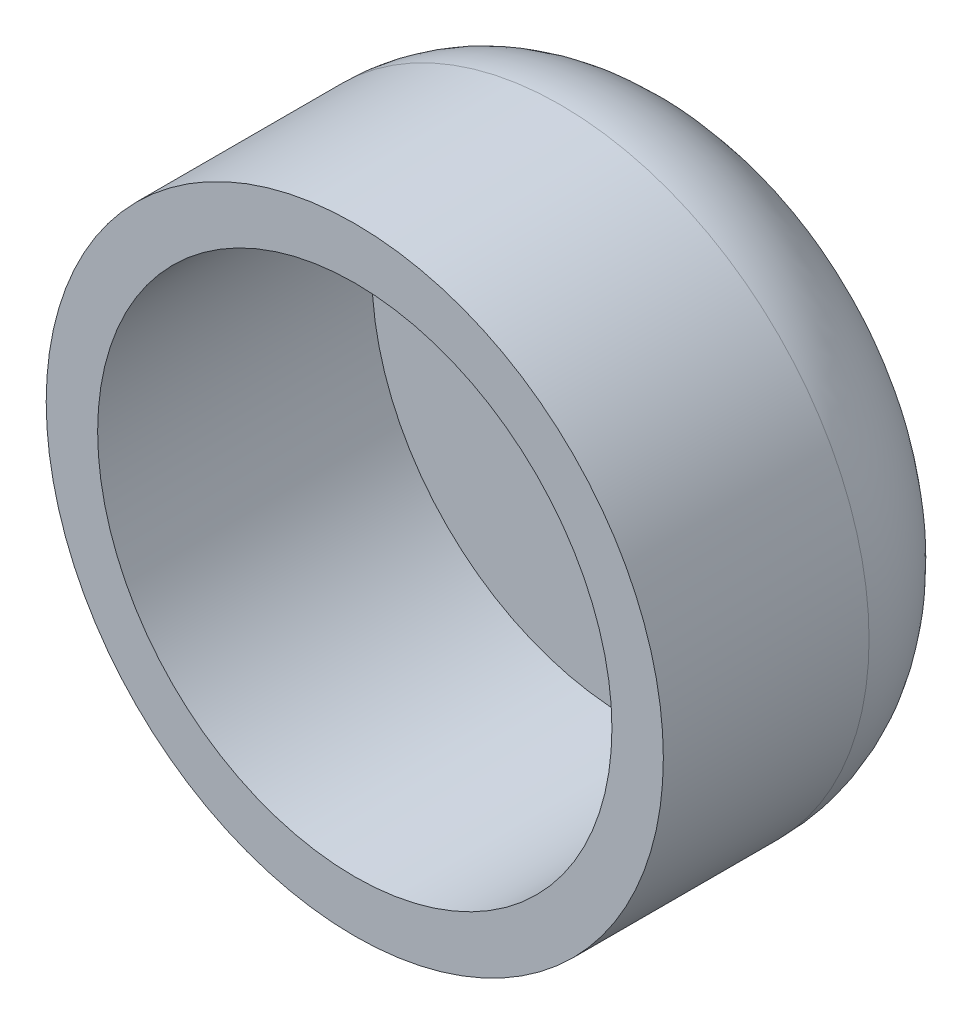
ISO-10303-21;
HEADER;
FILE_DESCRIPTION(('STEP AP214'),'2;1');
FILE_NAME('part.step','',(''),(''),'','','');
FILE_SCHEMA(('AUTOMOTIVE_DESIGN { 1 0 10303 214 1 1 1 1 }'));
ENDSEC;
DATA;
#1=APPLICATION_CONTEXT('core data for automotive mechanical design processes');
#2=APPLICATION_PROTOCOL_DEFINITION('international standard','automotive_design',2000,#1);
#3=PRODUCT_CONTEXT('',#1,'mechanical');
#4=PRODUCT('Part','Part','',(#3));
#5=PRODUCT_RELATED_PRODUCT_CATEGORY('part','',(#4));
#6=PRODUCT_DEFINITION_FORMATION('','',#4);
#7=PRODUCT_DEFINITION_CONTEXT('part definition',#1,'design');
#8=PRODUCT_DEFINITION('design','',#6,#7);
#9=PRODUCT_DEFINITION_SHAPE('','',#8);
#10=(LENGTH_UNIT() NAMED_UNIT(*) SI_UNIT(.MILLI.,.METRE.));
#11=(NAMED_UNIT(*) PLANE_ANGLE_UNIT() SI_UNIT($,.RADIAN.));
#12=(NAMED_UNIT(*) SI_UNIT($,.STERADIAN.) SOLID_ANGLE_UNIT());
#13=UNCERTAINTY_MEASURE_WITH_UNIT(LENGTH_MEASURE(1.E-05),#10,'distance_accuracy_value','');
#14=(GEOMETRIC_REPRESENTATION_CONTEXT(3) GLOBAL_UNCERTAINTY_ASSIGNED_CONTEXT((#13)) GLOBAL_UNIT_ASSIGNED_CONTEXT((#10,
#11,#12)) REPRESENTATION_CONTEXT('',''));
#15=CARTESIAN_POINT('',(0.,0.,0.));
#16=DIRECTION('',(0.,0.,1.));
#17=DIRECTION('',(1.,0.,0.));
#18=AXIS2_PLACEMENT_3D('',#15,#16,#17);
#19=CARTESIAN_POINT('',(0.,0.,-0.5));
#20=DIRECTION('',(0.,0.,1.));
#21=DIRECTION('',(1.,0.,0.));
#22=AXIS2_PLACEMENT_3D('',#19,#20,#21);
#23=CYLINDRICAL_SURFACE('',#22,0.9);
#24=CARTESIAN_POINT('',(0.,0.,-0.1));
#25=DIRECTION('',(0.,0.,1.));
#26=DIRECTION('',(1.,0.,0.));
#27=AXIS2_PLACEMENT_3D('',#24,#25,#26);
#28=CIRCLE('',#27,0.9);
#29=CARTESIAN_POINT('',(0.9,0.,-0.1));
#30=VERTEX_POINT('',#29);
#31=EDGE_CURVE('E44',#30,#30,#28,.T.);
#32=ORIENTED_EDGE('',*,*,#31,.T.);
#33=EDGE_LOOP('',(#32));
#34=FACE_BOUND('',#33,.T.);
#35=CARTESIAN_POINT('',(0.,0.,0.5));
#36=DIRECTION('',(0.,0.,1.));
#37=DIRECTION('',(1.00000000000001,0.,0.));
#38=AXIS2_PLACEMENT_3D('',#35,#36,#37);
#39=CIRCLE('',#38,0.9);
#40=CARTESIAN_POINT('',(0.900000000000009,0.,0.5));
#41=VERTEX_POINT('',#40);
#42=EDGE_CURVE('E57',#41,#41,#39,.T.);
#43=ORIENTED_EDGE('',*,*,#42,.F.);
#44=EDGE_LOOP('',(#43));
#45=FACE_BOUND('',#44,.T.);
#46=ADVANCED_FACE('F37',(#34,#45),#23,.T.);
#47=CARTESIAN_POINT('',(0.,0.,-0.5));
#48=DIRECTION('',(0.,0.,1.));
#49=DIRECTION('',(1.,0.,0.));
#50=AXIS2_PLACEMENT_3D('',#47,#48,#49);
#51=PLANE('',#50);
#52=CARTESIAN_POINT('',(0.,0.,-0.5));
#53=DIRECTION('',(0.,0.,1.));
#54=DIRECTION('',(1.,0.,0.));
#55=AXIS2_PLACEMENT_3D('',#52,#53,#54);
#56=CIRCLE('',#55,0.5);
#57=CARTESIAN_POINT('',(0.5,0.,-0.5));
#58=VERTEX_POINT('',#57);
#59=EDGE_CURVE('E10',#58,#58,#56,.F.);
#60=ORIENTED_EDGE('',*,*,#59,.T.);
#61=EDGE_LOOP('',(#60));
#62=FACE_BOUND('',#61,.T.);
#63=ADVANCED_FACE('F65',(#62),#51,.F.);
#64=CARTESIAN_POINT('',(0.,0.,-0.1));
#65=DIRECTION('',(0.,0.,1.));
#66=DIRECTION('',(1.,0.,0.));
#67=AXIS2_PLACEMENT_3D('',#64,#65,#66);
#68=TOROIDAL_SURFACE('',#67,0.5,0.4);
#69=ORIENTED_EDGE('',*,*,#59,.F.);
#70=EDGE_LOOP('',(#69));
#71=FACE_BOUND('',#70,.T.);
#72=ORIENTED_EDGE('',*,*,#31,.F.);
#73=EDGE_LOOP('',(#72));
#74=FACE_BOUND('',#73,.T.);
#75=ADVANCED_FACE('F39',(#71,#74),#68,.T.);
#76=CARTESIAN_POINT('',(0.,0.,0.5));
#77=DIRECTION('',(0.,0.,1.));
#78=DIRECTION('',(1.00000000000001,0.,0.));
#79=AXIS2_PLACEMENT_3D('',#76,#77,#78);
#80=PLANE('',#79);
#81=ORIENTED_EDGE('',*,*,#42,.T.);
#82=EDGE_LOOP('',(#81));
#83=FACE_BOUND('',#82,.T.);
#84=CARTESIAN_POINT('',(0.,0.,0.5));
#85=DIRECTION('',(0.,0.,1.));
#86=DIRECTION('',(1.00000000000001,0.,0.));
#87=AXIS2_PLACEMENT_3D('',#84,#85,#86);
#88=CIRCLE('',#87,0.75);
#89=CARTESIAN_POINT('',(0.750000000000008,0.,0.5));
#90=VERTEX_POINT('',#89);
#91=EDGE_CURVE('E52',#90,#90,#88,.F.);
#92=ORIENTED_EDGE('',*,*,#91,.T.);
#93=EDGE_LOOP('',(#92));
#94=FACE_BOUND('',#93,.T.);
#95=ADVANCED_FACE('F61',(#83,#94),#80,.T.);
#96=CARTESIAN_POINT('',(0.,0.,-0.3));
#97=DIRECTION('',(0.,0.,1.));
#98=DIRECTION('',(1.,0.,0.));
#99=AXIS2_PLACEMENT_3D('',#96,#97,#98);
#100=PLANE('',#99);
#101=CARTESIAN_POINT('',(0.,0.,-0.3));
#102=DIRECTION('',(0.,0.,1.));
#103=DIRECTION('',(1.,0.,0.));
#104=AXIS2_PLACEMENT_3D('',#101,#102,#103);
#105=CIRCLE('',#104,0.75);
#106=CARTESIAN_POINT('',(0.75,0.,-0.3));
#107=VERTEX_POINT('',#106);
#108=EDGE_CURVE('E48',#107,#107,#105,.T.);
#109=ORIENTED_EDGE('',*,*,#108,.T.);
#110=EDGE_LOOP('',(#109));
#111=FACE_BOUND('',#110,.T.);
#112=ADVANCED_FACE('F76',(#111),#100,.T.);
#113=CARTESIAN_POINT('',(0.,0.,-0.3));
#114=DIRECTION('',(0.,0.,1.));
#115=DIRECTION('',(1.,0.,0.));
#116=AXIS2_PLACEMENT_3D('',#113,#114,#115);
#117=CYLINDRICAL_SURFACE('',#116,0.75);
#118=ORIENTED_EDGE('',*,*,#108,.F.);
#119=EDGE_LOOP('',(#118));
#120=FACE_BOUND('',#119,.T.);
#121=ORIENTED_EDGE('',*,*,#91,.F.);
#122=EDGE_LOOP('',(#121));
#123=FACE_BOUND('',#122,.T.);
#124=ADVANCED_FACE('F73',(#120,#123),#117,.F.);
#125=CLOSED_SHELL('',(#46,#63,#75,#95,#112,#124));
#126=MANIFOLD_SOLID_BREP('B2',#125);
#127=ADVANCED_BREP_SHAPE_REPRESENTATION('',(#18,#126),#14);
#128=SHAPE_DEFINITION_REPRESENTATION(#9,#127);
ENDSEC;
END-ISO-10303-21;
